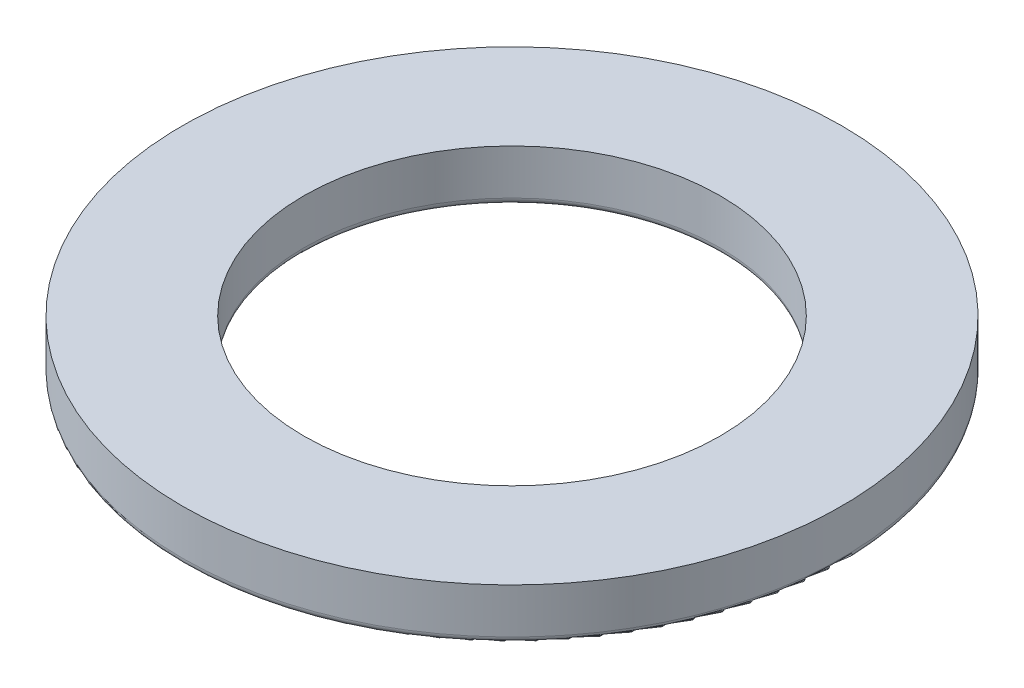
ISO-10303-21;
HEADER;
FILE_DESCRIPTION(('STEP AP214'),'2;1');
FILE_NAME('part.step','',(''),(''),'','','');
FILE_SCHEMA(('AUTOMOTIVE_DESIGN { 1 0 10303 214 1 1 1 1 }'));
ENDSEC;
DATA;
#1=APPLICATION_CONTEXT('core data for automotive mechanical design processes');
#2=APPLICATION_PROTOCOL_DEFINITION('international standard','automotive_design',2000,#1);
#3=PRODUCT_CONTEXT('',#1,'mechanical');
#4=PRODUCT('Part','Part','',(#3));
#5=PRODUCT_RELATED_PRODUCT_CATEGORY('part','',(#4));
#6=PRODUCT_DEFINITION_FORMATION('','',#4);
#7=PRODUCT_DEFINITION_CONTEXT('part definition',#1,'design');
#8=PRODUCT_DEFINITION('design','',#6,#7);
#9=PRODUCT_DEFINITION_SHAPE('','',#8);
#10=(LENGTH_UNIT() NAMED_UNIT(*) SI_UNIT(.MILLI.,.METRE.));
#11=(NAMED_UNIT(*) PLANE_ANGLE_UNIT() SI_UNIT($,.RADIAN.));
#12=(NAMED_UNIT(*) SI_UNIT($,.STERADIAN.) SOLID_ANGLE_UNIT());
#13=UNCERTAINTY_MEASURE_WITH_UNIT(LENGTH_MEASURE(1.E-05),#10,'distance_accuracy_value','');
#14=(GEOMETRIC_REPRESENTATION_CONTEXT(3) GLOBAL_UNCERTAINTY_ASSIGNED_CONTEXT((#13)) GLOBAL_UNIT_ASSIGNED_CONTEXT((#10,
#11,#12)) REPRESENTATION_CONTEXT('',''));
#15=CARTESIAN_POINT('',(0.,0.,0.));
#16=DIRECTION('',(0.,0.,1.));
#17=DIRECTION('',(1.,0.,0.));
#18=AXIS2_PLACEMENT_3D('',#15,#16,#17);
#19=CARTESIAN_POINT('',(0.,1.5,0.));
#20=DIRECTION('',(0.,1.,0.));
#21=DIRECTION('',(0.,0.,1.));
#22=AXIS2_PLACEMENT_3D('',#19,#20,#21);
#23=PLANE('',#22);
#24=CARTESIAN_POINT('',(0.,1.5,0.));
#25=DIRECTION('',(0.,1.,0.));
#26=DIRECTION('',(0.,0.,1.));
#27=AXIS2_PLACEMENT_3D('',#24,#25,#26);
#28=CIRCLE('',#27,9.5);
#29=CARTESIAN_POINT('',(0.,1.5,9.5));
#30=VERTEX_POINT('',#29);
#31=EDGE_CURVE('E65',#30,#30,#28,.T.);
#32=ORIENTED_EDGE('',*,*,#31,.T.);
#33=EDGE_LOOP('',(#32));
#34=FACE_BOUND('',#33,.T.);
#35=CARTESIAN_POINT('',(0.,1.5,0.));
#36=DIRECTION('',(0.,1.,0.));
#37=DIRECTION('',(0.,0.,1.));
#38=AXIS2_PLACEMENT_3D('',#35,#36,#37);
#39=CIRCLE('',#38,6.);
#40=CARTESIAN_POINT('',(0.,1.5,6.));
#41=VERTEX_POINT('',#40);
#42=EDGE_CURVE('E69',#41,#41,#39,.T.);
#43=ORIENTED_EDGE('',*,*,#42,.F.);
#44=EDGE_LOOP('',(#43));
#45=FACE_BOUND('',#44,.T.);
#46=ADVANCED_FACE('F41',(#34,#45),#23,.T.);
#47=CARTESIAN_POINT('',(0.,0.,0.));
#48=DIRECTION('',(0.,1.,0.));
#49=DIRECTION('',(0.,0.,1.));
#50=AXIS2_PLACEMENT_3D('',#47,#48,#49);
#51=PLANE('',#50);
#52=CARTESIAN_POINT('',(0.,0.,0.));
#53=DIRECTION('',(0.,1.,0.));
#54=DIRECTION('',(0.,0.,1.));
#55=AXIS2_PLACEMENT_3D('',#52,#53,#54);
#56=CIRCLE('',#55,6.2);
#57=CARTESIAN_POINT('',(0.,0.,6.2));
#58=VERTEX_POINT('',#57);
#59=EDGE_CURVE('E54',#58,#58,#56,.T.);
#60=ORIENTED_EDGE('',*,*,#59,.T.);
#61=EDGE_LOOP('',(#60));
#62=FACE_BOUND('',#61,.T.);
#63=CARTESIAN_POINT('',(0.,0.,0.));
#64=DIRECTION('',(0.,1.,0.));
#65=DIRECTION('',(0.,0.,1.));
#66=AXIS2_PLACEMENT_3D('',#63,#64,#65);
#67=CIRCLE('',#66,9.3);
#68=CARTESIAN_POINT('',(0.,0.,9.3));
#69=VERTEX_POINT('',#68);
#70=EDGE_CURVE('E59',#69,#69,#67,.F.);
#71=ORIENTED_EDGE('',*,*,#70,.T.);
#72=EDGE_LOOP('',(#71));
#73=FACE_BOUND('',#72,.T.);
#74=ADVANCED_FACE('F77',(#62,#73),#51,.F.);
#75=CARTESIAN_POINT('',(0.,1.5,0.));
#76=DIRECTION('',(0.,-1.,0.));
#77=DIRECTION('',(0.,0.,-1.));
#78=AXIS2_PLACEMENT_3D('',#75,#76,#77);
#79=CYLINDRICAL_SURFACE('',#78,9.5);
#80=CARTESIAN_POINT('',(0.,0.2,0.));
#81=DIRECTION('',(0.,1.,0.));
#82=DIRECTION('',(0.,0.,1.));
#83=AXIS2_PLACEMENT_3D('',#80,#81,#82);
#84=CIRCLE('',#83,9.5);
#85=CARTESIAN_POINT('',(0.,0.2,9.5));
#86=VERTEX_POINT('',#85);
#87=EDGE_CURVE('E10',#86,#86,#84,.T.);
#88=ORIENTED_EDGE('',*,*,#87,.T.);
#89=EDGE_LOOP('',(#88));
#90=FACE_BOUND('',#89,.T.);
#91=ORIENTED_EDGE('',*,*,#31,.F.);
#92=EDGE_LOOP('',(#91));
#93=FACE_BOUND('',#92,.T.);
#94=ADVANCED_FACE('F83',(#90,#93),#79,.T.);
#95=CARTESIAN_POINT('',(0.,1.5,0.));
#96=DIRECTION('',(0.,-1.,0.));
#97=DIRECTION('',(0.,0.,-1.));
#98=AXIS2_PLACEMENT_3D('',#95,#96,#97);
#99=CYLINDRICAL_SURFACE('',#98,6.);
#100=CARTESIAN_POINT('',(0.,0.2,0.));
#101=DIRECTION('',(0.,1.,0.));
#102=DIRECTION('',(0.,0.,1.));
#103=AXIS2_PLACEMENT_3D('',#100,#101,#102);
#104=CIRCLE('',#103,6.);
#105=CARTESIAN_POINT('',(0.,0.2,6.));
#106=VERTEX_POINT('',#105);
#107=EDGE_CURVE('E49',#106,#106,#104,.F.);
#108=ORIENTED_EDGE('',*,*,#107,.T.);
#109=EDGE_LOOP('',(#108));
#110=FACE_BOUND('',#109,.T.);
#111=ORIENTED_EDGE('',*,*,#42,.T.);
#112=EDGE_LOOP('',(#111));
#113=FACE_BOUND('',#112,.T.);
#114=ADVANCED_FACE('F74',(#110,#113),#99,.F.);
#115=CARTESIAN_POINT('',(0.,0.2,0.));
#116=DIRECTION('',(0.,1.,0.));
#117=DIRECTION('',(0.,0.,1.));
#118=AXIS2_PLACEMENT_3D('',#115,#116,#117);
#119=TOROIDAL_SURFACE('',#118,6.2,0.2);
#120=ORIENTED_EDGE('',*,*,#107,.F.);
#121=EDGE_LOOP('',(#120));
#122=FACE_BOUND('',#121,.T.);
#123=ORIENTED_EDGE('',*,*,#59,.F.);
#124=EDGE_LOOP('',(#123));
#125=FACE_BOUND('',#124,.T.);
#126=ADVANCED_FACE('F89',(#122,#125),#119,.T.);
#127=CARTESIAN_POINT('',(0.,0.2,0.));
#128=DIRECTION('',(0.,1.,0.));
#129=DIRECTION('',(0.,0.,1.));
#130=AXIS2_PLACEMENT_3D('',#127,#128,#129);
#131=TOROIDAL_SURFACE('',#130,9.3,0.2);
#132=ORIENTED_EDGE('',*,*,#70,.F.);
#133=EDGE_LOOP('',(#132));
#134=FACE_BOUND('',#133,.T.);
#135=ORIENTED_EDGE('',*,*,#87,.F.);
#136=EDGE_LOOP('',(#135));
#137=FACE_BOUND('',#136,.T.);
#138=ADVANCED_FACE('F43',(#134,#137),#131,.T.);
#139=CLOSED_SHELL('',(#46,#74,#94,#114,#126,#138));
#140=MANIFOLD_SOLID_BREP('B2',#139);
#141=ADVANCED_BREP_SHAPE_REPRESENTATION('',(#18,#140),#14);
#142=SHAPE_DEFINITION_REPRESENTATION(#9,#141);
ENDSEC;
END-ISO-10303-21;
